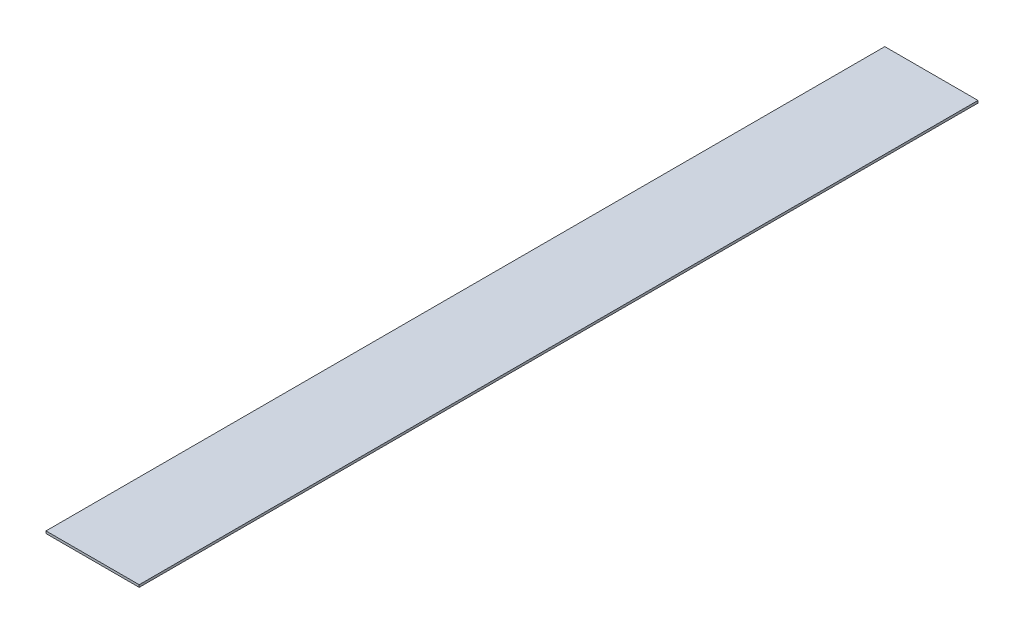
ISO-10303-21;
HEADER;
FILE_DESCRIPTION(('STEP AP214'),'2;1');
FILE_NAME('part.step','',(''),(''),'','','');
FILE_SCHEMA(('AUTOMOTIVE_DESIGN { 1 0 10303 214 1 1 1 1 }'));
ENDSEC;
DATA;
#1=APPLICATION_CONTEXT('core data for automotive mechanical design processes');
#2=APPLICATION_PROTOCOL_DEFINITION('international standard','automotive_design',2000,#1);
#3=PRODUCT_CONTEXT('',#1,'mechanical');
#4=PRODUCT('Part','Part','',(#3));
#5=PRODUCT_RELATED_PRODUCT_CATEGORY('part','',(#4));
#6=PRODUCT_DEFINITION_FORMATION('','',#4);
#7=PRODUCT_DEFINITION_CONTEXT('part definition',#1,'design');
#8=PRODUCT_DEFINITION('design','',#6,#7);
#9=PRODUCT_DEFINITION_SHAPE('','',#8);
#10=(LENGTH_UNIT() NAMED_UNIT(*) SI_UNIT(.MILLI.,.METRE.));
#11=(NAMED_UNIT(*) PLANE_ANGLE_UNIT() SI_UNIT($,.RADIAN.));
#12=(NAMED_UNIT(*) SI_UNIT($,.STERADIAN.) SOLID_ANGLE_UNIT());
#13=UNCERTAINTY_MEASURE_WITH_UNIT(LENGTH_MEASURE(1.E-05),#10,'distance_accuracy_value','');
#14=(GEOMETRIC_REPRESENTATION_CONTEXT(3) GLOBAL_UNCERTAINTY_ASSIGNED_CONTEXT((#13)) GLOBAL_UNIT_ASSIGNED_CONTEXT((#10,
#11,#12)) REPRESENTATION_CONTEXT('',''));
#15=CARTESIAN_POINT('',(0.,0.,0.));
#16=DIRECTION('',(0.,0.,1.));
#17=DIRECTION('',(1.,0.,0.));
#18=AXIS2_PLACEMENT_3D('',#15,#16,#17);
#19=CARTESIAN_POINT('',(25.4,1.27,228.6));
#20=DIRECTION('',(-1.,0.,0.));
#21=DIRECTION('',(0.,0.,1.));
#22=AXIS2_PLACEMENT_3D('',#19,#20,#21);
#23=PLANE('',#22);
#24=DIRECTION('',(0.,0.,-1.));
#25=VECTOR('',#24,1.);
#26=CARTESIAN_POINT('',(25.4,0.,228.6));
#27=LINE('',#26,#25);
#28=CARTESIAN_POINT('',(25.4,0.,228.6));
#29=VERTEX_POINT('',#28);
#30=CARTESIAN_POINT('',(25.4,0.,-228.6));
#31=VERTEX_POINT('',#30);
#32=EDGE_CURVE('E97',#29,#31,#27,.T.);
#33=ORIENTED_EDGE('',*,*,#32,.T.);
#34=DIRECTION('',(0.,-1.,0.));
#35=VECTOR('',#34,1.);
#36=CARTESIAN_POINT('',(25.4,1.27,-228.6));
#37=LINE('',#36,#35);
#38=CARTESIAN_POINT('',(25.4,1.27,-228.6));
#39=VERTEX_POINT('',#38);
#40=EDGE_CURVE('E11',#39,#31,#37,.T.);
#41=ORIENTED_EDGE('',*,*,#40,.F.);
#42=DIRECTION('',(0.,0.,-1.));
#43=VECTOR('',#42,1.);
#44=CARTESIAN_POINT('',(25.4,1.27,228.6));
#45=LINE('',#44,#43);
#46=CARTESIAN_POINT('',(25.4,1.27,228.6));
#47=VERTEX_POINT('',#46);
#48=EDGE_CURVE('E85',#47,#39,#45,.T.);
#49=ORIENTED_EDGE('',*,*,#48,.F.);
#50=DIRECTION('',(0.,-1.,0.));
#51=VECTOR('',#50,1.);
#52=CARTESIAN_POINT('',(25.4,1.27,228.6));
#53=LINE('',#52,#51);
#54=EDGE_CURVE('E93',#47,#29,#53,.T.);
#55=ORIENTED_EDGE('',*,*,#54,.T.);
#56=EDGE_LOOP('',(#33,#41,#49,#55));
#57=FACE_BOUND('',#56,.T.);
#58=ADVANCED_FACE('F34',(#57),#23,.F.);
#59=CARTESIAN_POINT('',(-25.4,1.27,-228.6));
#60=DIRECTION('',(0.,0.,1.));
#61=DIRECTION('',(1.,0.,0.));
#62=AXIS2_PLACEMENT_3D('',#59,#60,#61);
#63=PLANE('',#62);
#64=DIRECTION('',(-1.,0.,0.));
#65=VECTOR('',#64,1.);
#66=CARTESIAN_POINT('',(-25.4,0.,-228.6));
#67=LINE('',#66,#65);
#68=CARTESIAN_POINT('',(-25.4,0.,-228.6));
#69=VERTEX_POINT('',#68);
#70=EDGE_CURVE('E89',#31,#69,#67,.T.);
#71=ORIENTED_EDGE('',*,*,#70,.T.);
#72=DIRECTION('',(0.,-1.,0.));
#73=VECTOR('',#72,1.);
#74=CARTESIAN_POINT('',(-25.4,1.27,-228.6));
#75=LINE('',#74,#73);
#76=CARTESIAN_POINT('',(-25.4,1.27,-228.6));
#77=VERTEX_POINT('',#76);
#78=EDGE_CURVE('E42',#77,#69,#75,.T.);
#79=ORIENTED_EDGE('',*,*,#78,.F.);
#80=DIRECTION('',(-1.,0.,0.));
#81=VECTOR('',#80,1.);
#82=CARTESIAN_POINT('',(-25.4,1.27,-228.6));
#83=LINE('',#82,#81);
#84=EDGE_CURVE('E80',#39,#77,#83,.T.);
#85=ORIENTED_EDGE('',*,*,#84,.F.);
#86=ORIENTED_EDGE('',*,*,#40,.T.);
#87=EDGE_LOOP('',(#71,#79,#85,#86));
#88=FACE_BOUND('',#87,.T.);
#89=ADVANCED_FACE('F88',(#88),#63,.F.);
#90=CARTESIAN_POINT('',(-25.4,1.27,228.6));
#91=DIRECTION('',(1.,0.,0.));
#92=DIRECTION('',(0.,0.,-1.));
#93=AXIS2_PLACEMENT_3D('',#90,#91,#92);
#94=PLANE('',#93);
#95=DIRECTION('',(0.,0.,1.));
#96=VECTOR('',#95,1.);
#97=CARTESIAN_POINT('',(-25.4,0.,228.6));
#98=LINE('',#97,#96);
#99=CARTESIAN_POINT('',(-25.4,0.,228.6));
#100=VERTEX_POINT('',#99);
#101=EDGE_CURVE('E67',#69,#100,#98,.T.);
#102=ORIENTED_EDGE('',*,*,#101,.T.);
#103=DIRECTION('',(0.,-1.,0.));
#104=VECTOR('',#103,1.);
#105=CARTESIAN_POINT('',(-25.4,1.27,228.6));
#106=LINE('',#105,#104);
#107=CARTESIAN_POINT('',(-25.4,1.27,228.6));
#108=VERTEX_POINT('',#107);
#109=EDGE_CURVE('E90',#108,#100,#106,.T.);
#110=ORIENTED_EDGE('',*,*,#109,.F.);
#111=DIRECTION('',(0.,0.,1.));
#112=VECTOR('',#111,1.);
#113=CARTESIAN_POINT('',(-25.4,1.27,228.6));
#114=LINE('',#113,#112);
#115=EDGE_CURVE('E83',#77,#108,#114,.T.);
#116=ORIENTED_EDGE('',*,*,#115,.F.);
#117=ORIENTED_EDGE('',*,*,#78,.T.);
#118=EDGE_LOOP('',(#102,#110,#116,#117));
#119=FACE_BOUND('',#118,.T.);
#120=ADVANCED_FACE('F91',(#119),#94,.F.);
#121=CARTESIAN_POINT('',(-25.4,1.27,228.6));
#122=DIRECTION('',(0.,0.,-1.));
#123=DIRECTION('',(-1.,0.,0.));
#124=AXIS2_PLACEMENT_3D('',#121,#122,#123);
#125=PLANE('',#124);
#126=DIRECTION('',(1.,0.,0.));
#127=VECTOR('',#126,1.);
#128=CARTESIAN_POINT('',(-25.4,0.,228.6));
#129=LINE('',#128,#127);
#130=EDGE_CURVE('E73',#100,#29,#129,.T.);
#131=ORIENTED_EDGE('',*,*,#130,.T.);
#132=ORIENTED_EDGE('',*,*,#54,.F.);
#133=DIRECTION('',(1.,0.,0.));
#134=VECTOR('',#133,1.);
#135=CARTESIAN_POINT('',(-25.4,1.27,228.6));
#136=LINE('',#135,#134);
#137=EDGE_CURVE('E50',#108,#47,#136,.T.);
#138=ORIENTED_EDGE('',*,*,#137,.F.);
#139=ORIENTED_EDGE('',*,*,#109,.T.);
#140=EDGE_LOOP('',(#131,#132,#138,#139));
#141=FACE_BOUND('',#140,.T.);
#142=ADVANCED_FACE('F104',(#141),#125,.F.);
#143=CARTESIAN_POINT('',(0.,1.27,0.));
#144=DIRECTION('',(0.,-1.,0.));
#145=DIRECTION('',(0.,0.,-1.));
#146=AXIS2_PLACEMENT_3D('',#143,#144,#145);
#147=PLANE('',#146);
#148=ORIENTED_EDGE('',*,*,#48,.T.);
#149=ORIENTED_EDGE('',*,*,#84,.T.);
#150=ORIENTED_EDGE('',*,*,#115,.T.);
#151=ORIENTED_EDGE('',*,*,#137,.T.);
#152=EDGE_LOOP('',(#148,#149,#150,#151));
#153=FACE_BOUND('',#152,.T.);
#154=ADVANCED_FACE('F81',(#153),#147,.F.);
#155=CARTESIAN_POINT('',(0.,0.,0.));
#156=DIRECTION('',(0.,-1.,0.));
#157=DIRECTION('',(0.,0.,-1.));
#158=AXIS2_PLACEMENT_3D('',#155,#156,#157);
#159=PLANE('',#158);
#160=ORIENTED_EDGE('',*,*,#32,.F.);
#161=ORIENTED_EDGE('',*,*,#130,.F.);
#162=ORIENTED_EDGE('',*,*,#101,.F.);
#163=ORIENTED_EDGE('',*,*,#70,.F.);
#164=EDGE_LOOP('',(#160,#161,#162,#163));
#165=FACE_BOUND('',#164,.T.);
#166=ADVANCED_FACE('F107',(#165),#159,.T.);
#167=CLOSED_SHELL('',(#58,#89,#120,#142,#154,#166));
#168=MANIFOLD_SOLID_BREP('B2',#167);
#169=ADVANCED_BREP_SHAPE_REPRESENTATION('',(#18,#168),#14);
#170=SHAPE_DEFINITION_REPRESENTATION(#9,#169);
ENDSEC;
END-ISO-10303-21;
